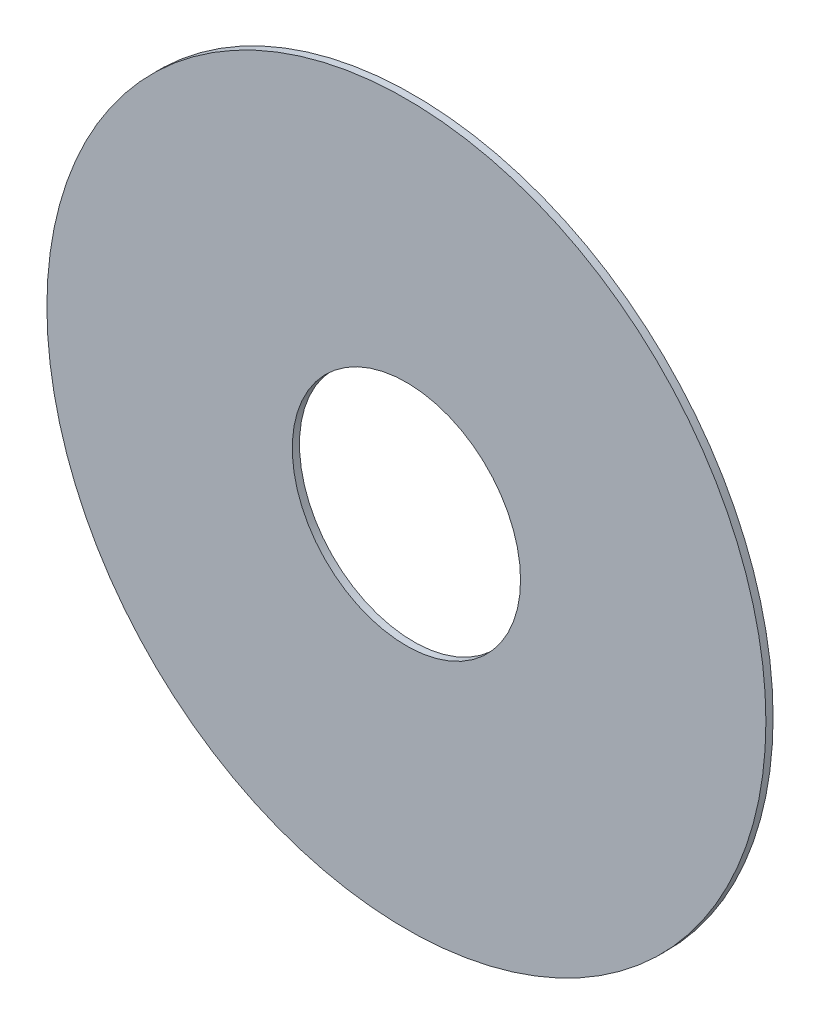
ISO-10303-21;
HEADER;
FILE_DESCRIPTION(('STEP AP214'),'2;1');
FILE_NAME('part.step','',(''),(''),'','','');
FILE_SCHEMA(('AUTOMOTIVE_DESIGN { 1 0 10303 214 1 1 1 1 }'));
ENDSEC;
DATA;
#1=APPLICATION_CONTEXT('core data for automotive mechanical design processes');
#2=APPLICATION_PROTOCOL_DEFINITION('international standard','automotive_design',2000,#1);
#3=PRODUCT_CONTEXT('',#1,'mechanical');
#4=PRODUCT('Part','Part','',(#3));
#5=PRODUCT_RELATED_PRODUCT_CATEGORY('part','',(#4));
#6=PRODUCT_DEFINITION_FORMATION('','',#4);
#7=PRODUCT_DEFINITION_CONTEXT('part definition',#1,'design');
#8=PRODUCT_DEFINITION('design','',#6,#7);
#9=PRODUCT_DEFINITION_SHAPE('','',#8);
#10=(LENGTH_UNIT() NAMED_UNIT(*) SI_UNIT(.MILLI.,.METRE.));
#11=(NAMED_UNIT(*) PLANE_ANGLE_UNIT() SI_UNIT($,.RADIAN.));
#12=(NAMED_UNIT(*) SI_UNIT($,.STERADIAN.) SOLID_ANGLE_UNIT());
#13=UNCERTAINTY_MEASURE_WITH_UNIT(LENGTH_MEASURE(1.E-05),#10,'distance_accuracy_value','');
#14=(GEOMETRIC_REPRESENTATION_CONTEXT(3) GLOBAL_UNCERTAINTY_ASSIGNED_CONTEXT((#13)) GLOBAL_UNIT_ASSIGNED_CONTEXT((#10,
#11,#12)) REPRESENTATION_CONTEXT('',''));
#15=CARTESIAN_POINT('',(0.,0.,0.));
#16=DIRECTION('',(0.,0.,1.));
#17=DIRECTION('',(1.,0.,0.));
#18=AXIS2_PLACEMENT_3D('',#15,#16,#17);
#19=CARTESIAN_POINT('',(0.,0.,2.));
#20=DIRECTION('',(0.,0.,1.));
#21=DIRECTION('',(1.,0.,0.));
#22=AXIS2_PLACEMENT_3D('',#19,#20,#21);
#23=PLANE('',#22);
#24=CARTESIAN_POINT('',(0.,0.,2.));
#25=DIRECTION('',(0.,0.,1.));
#26=DIRECTION('',(1.,0.,0.));
#27=AXIS2_PLACEMENT_3D('',#24,#25,#26);
#28=CIRCLE('',#27,100.);
#29=CARTESIAN_POINT('',(100.,0.,2.));
#30=VERTEX_POINT('',#29);
#31=EDGE_CURVE('E10',#30,#30,#28,.T.);
#32=ORIENTED_EDGE('',*,*,#31,.T.);
#33=EDGE_LOOP('',(#32));
#34=FACE_BOUND('',#33,.T.);
#35=CARTESIAN_POINT('',(0.,0.,2.));
#36=DIRECTION('',(0.,0.,1.));
#37=DIRECTION('',(1.,0.,0.));
#38=AXIS2_PLACEMENT_3D('',#35,#36,#37);
#39=CIRCLE('',#38,31.75);
#40=CARTESIAN_POINT('',(31.75,0.,2.));
#41=VERTEX_POINT('',#40);
#42=EDGE_CURVE('E41',#41,#41,#39,.T.);
#43=ORIENTED_EDGE('',*,*,#42,.F.);
#44=EDGE_LOOP('',(#43));
#45=FACE_BOUND('',#44,.T.);
#46=ADVANCED_FACE('F30',(#34,#45),#23,.T.);
#47=CARTESIAN_POINT('',(0.,0.,0.));
#48=DIRECTION('',(0.,0.,1.));
#49=DIRECTION('',(1.,0.,0.));
#50=AXIS2_PLACEMENT_3D('',#47,#48,#49);
#51=PLANE('',#50);
#52=CARTESIAN_POINT('',(0.,0.,0.));
#53=DIRECTION('',(0.,0.,1.));
#54=DIRECTION('',(1.,0.,0.));
#55=AXIS2_PLACEMENT_3D('',#52,#53,#54);
#56=CIRCLE('',#55,100.);
#57=CARTESIAN_POINT('',(100.,0.,0.));
#58=VERTEX_POINT('',#57);
#59=EDGE_CURVE('E34',#58,#58,#56,.T.);
#60=ORIENTED_EDGE('',*,*,#59,.F.);
#61=EDGE_LOOP('',(#60));
#62=FACE_BOUND('',#61,.T.);
#63=CARTESIAN_POINT('',(0.,0.,0.));
#64=DIRECTION('',(0.,0.,1.));
#65=DIRECTION('',(1.,0.,0.));
#66=AXIS2_PLACEMENT_3D('',#63,#64,#65);
#67=CIRCLE('',#66,31.75);
#68=CARTESIAN_POINT('',(31.75,0.,0.));
#69=VERTEX_POINT('',#68);
#70=EDGE_CURVE('E43',#69,#69,#67,.T.);
#71=ORIENTED_EDGE('',*,*,#70,.T.);
#72=EDGE_LOOP('',(#71));
#73=FACE_BOUND('',#72,.T.);
#74=ADVANCED_FACE('F53',(#62,#73),#51,.F.);
#75=CARTESIAN_POINT('',(0.,0.,2.));
#76=DIRECTION('',(0.,0.,-1.));
#77=DIRECTION('',(-1.,0.,0.));
#78=AXIS2_PLACEMENT_3D('',#75,#76,#77);
#79=CYLINDRICAL_SURFACE('',#78,100.);
#80=ORIENTED_EDGE('',*,*,#31,.F.);
#81=EDGE_LOOP('',(#80));
#82=FACE_BOUND('',#81,.T.);
#83=ORIENTED_EDGE('',*,*,#59,.T.);
#84=EDGE_LOOP('',(#83));
#85=FACE_BOUND('',#84,.T.);
#86=ADVANCED_FACE('F32',(#82,#85),#79,.T.);
#87=CARTESIAN_POINT('',(0.,0.,2.));
#88=DIRECTION('',(0.,0.,-1.));
#89=DIRECTION('',(-1.,0.,0.));
#90=AXIS2_PLACEMENT_3D('',#87,#88,#89);
#91=CYLINDRICAL_SURFACE('',#90,31.75);
#92=ORIENTED_EDGE('',*,*,#42,.T.);
#93=EDGE_LOOP('',(#92));
#94=FACE_BOUND('',#93,.T.);
#95=ORIENTED_EDGE('',*,*,#70,.F.);
#96=EDGE_LOOP('',(#95));
#97=FACE_BOUND('',#96,.T.);
#98=ADVANCED_FACE('F49',(#94,#97),#91,.F.);
#99=CLOSED_SHELL('',(#46,#74,#86,#98));
#100=MANIFOLD_SOLID_BREP('B2',#99);
#101=ADVANCED_BREP_SHAPE_REPRESENTATION('',(#18,#100),#14);
#102=SHAPE_DEFINITION_REPRESENTATION(#9,#101);
ENDSEC;
END-ISO-10303-21;
